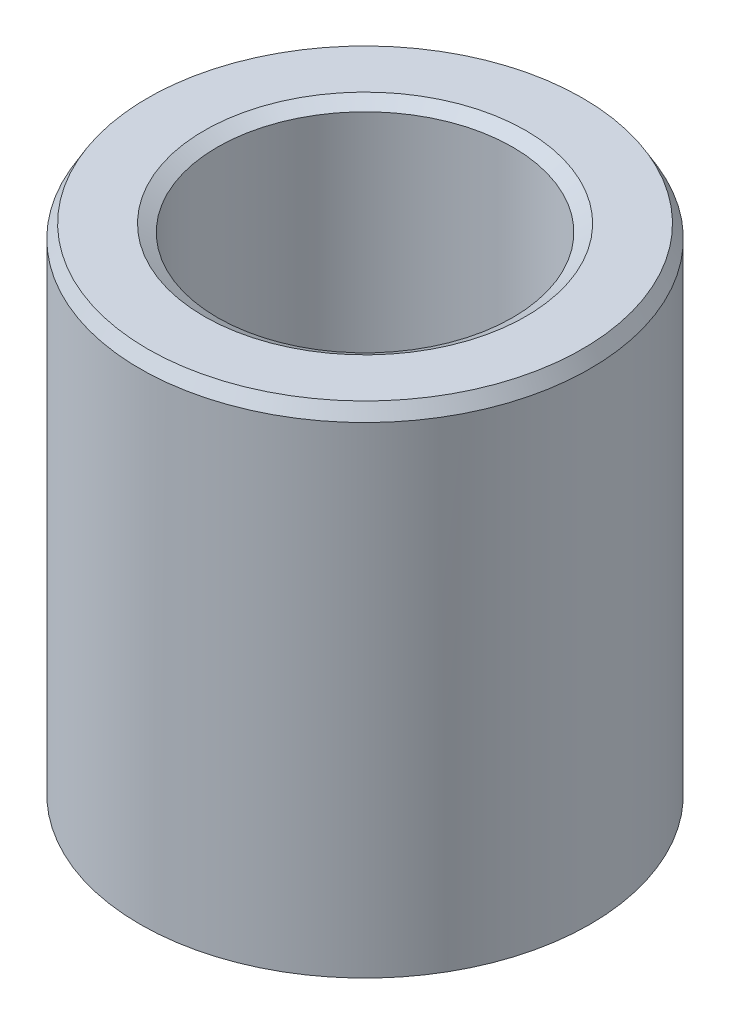
ISO-10303-21;
HEADER;
FILE_DESCRIPTION(('STEP AP214'),'2;1');
FILE_NAME('part.step','',(''),(''),'','','');
FILE_SCHEMA(('AUTOMOTIVE_DESIGN { 1 0 10303 214 1 1 1 1 }'));
ENDSEC;
DATA;
#1=APPLICATION_CONTEXT('core data for automotive mechanical design processes');
#2=APPLICATION_PROTOCOL_DEFINITION('international standard','automotive_design',2000,#1);
#3=PRODUCT_CONTEXT('',#1,'mechanical');
#4=PRODUCT('Part','Part','',(#3));
#5=PRODUCT_RELATED_PRODUCT_CATEGORY('part','',(#4));
#6=PRODUCT_DEFINITION_FORMATION('','',#4);
#7=PRODUCT_DEFINITION_CONTEXT('part definition',#1,'design');
#8=PRODUCT_DEFINITION('design','',#6,#7);
#9=PRODUCT_DEFINITION_SHAPE('','',#8);
#10=(LENGTH_UNIT() NAMED_UNIT(*) SI_UNIT(.MILLI.,.METRE.));
#11=(NAMED_UNIT(*) PLANE_ANGLE_UNIT() SI_UNIT($,.RADIAN.));
#12=(NAMED_UNIT(*) SI_UNIT($,.STERADIAN.) SOLID_ANGLE_UNIT());
#13=UNCERTAINTY_MEASURE_WITH_UNIT(LENGTH_MEASURE(1.E-05),#10,'distance_accuracy_value','');
#14=(GEOMETRIC_REPRESENTATION_CONTEXT(3) GLOBAL_UNCERTAINTY_ASSIGNED_CONTEXT((#13)) GLOBAL_UNIT_ASSIGNED_CONTEXT((#10,
#11,#12)) REPRESENTATION_CONTEXT('',''));
#15=CARTESIAN_POINT('',(0.,0.,0.));
#16=DIRECTION('',(0.,0.,1.));
#17=DIRECTION('',(1.,0.,0.));
#18=AXIS2_PLACEMENT_3D('',#15,#16,#17);
#19=CARTESIAN_POINT('',(0.,33.4597432472201,0.));
#20=DIRECTION('',(0.,-1.,0.));
#21=DIRECTION('',(0.,0.,-1.));
#22=AXIS2_PLACEMENT_3D('',#19,#20,#21);
#23=CYLINDRICAL_SURFACE('',#22,15.);
#24=CARTESIAN_POINT('',(0.,0.510710758820088,0.));
#25=DIRECTION('',(0.,1.,0.));
#26=DIRECTION('',(0.,0.,1.));
#27=AXIS2_PLACEMENT_3D('',#24,#25,#26);
#28=CIRCLE('',#27,15.);
#29=CARTESIAN_POINT('',(0.,0.510710758820088,15.));
#30=VERTEX_POINT('',#29);
#31=EDGE_CURVE('E10',#30,#30,#28,.T.);
#32=ORIENTED_EDGE('',*,*,#31,.T.);
#33=EDGE_LOOP('',(#32));
#34=FACE_BOUND('',#33,.T.);
#35=CARTESIAN_POINT('',(0.,32.5751662649717,0.));
#36=DIRECTION('',(0.,1.,0.));
#37=DIRECTION('',(0.,0.,1.));
#38=AXIS2_PLACEMENT_3D('',#35,#36,#37);
#39=CIRCLE('',#38,15.);
#40=CARTESIAN_POINT('',(0.,32.5751662649716,-15.));
#41=VERTEX_POINT('',#40);
#42=EDGE_CURVE('E50',#41,#41,#39,.F.);
#43=ORIENTED_EDGE('',*,*,#42,.T.);
#44=EDGE_LOOP('',(#43));
#45=FACE_BOUND('',#44,.T.);
#46=ADVANCED_FACE('F39',(#34,#45),#23,.T.);
#47=CARTESIAN_POINT('',(0.,33.4597432472201,0.));
#48=DIRECTION('',(0.,1.,0.));
#49=DIRECTION('',(0.,0.,1.));
#50=AXIS2_PLACEMENT_3D('',#47,#48,#49);
#51=PLANE('',#50);
#52=CARTESIAN_POINT('',(0.,33.4597432472201,0.));
#53=DIRECTION('',(0.,1.,0.));
#54=DIRECTION('',(0.,0.,1.));
#55=AXIS2_PLACEMENT_3D('',#52,#53,#54);
#56=CIRCLE('',#55,10.7254369156351);
#57=CARTESIAN_POINT('',(0.,33.4597432472201,10.7254369156351));
#58=VERTEX_POINT('',#57);
#59=EDGE_CURVE('E58',#58,#58,#56,.F.);
#60=ORIENTED_EDGE('',*,*,#59,.T.);
#61=EDGE_LOOP('',(#60));
#62=FACE_BOUND('',#61,.T.);
#63=CARTESIAN_POINT('',(0.,33.4597432472201,0.));
#64=DIRECTION('',(0.,1.,0.));
#65=DIRECTION('',(0.,0.,1.));
#66=AXIS2_PLACEMENT_3D('',#63,#64,#65);
#67=CIRCLE('',#66,14.4892892411799);
#68=CARTESIAN_POINT('',(0.,33.4597432472201,-14.4892892411799));
#69=VERTEX_POINT('',#68);
#70=EDGE_CURVE('E61',#69,#69,#67,.T.);
#71=ORIENTED_EDGE('',*,*,#70,.T.);
#72=EDGE_LOOP('',(#71));
#73=FACE_BOUND('',#72,.T.);
#74=ADVANCED_FACE('F88',(#62,#73),#51,.T.);
#75=CARTESIAN_POINT('',(0.,0.,0.));
#76=DIRECTION('',(0.,1.,0.));
#77=DIRECTION('',(0.,0.,1.));
#78=AXIS2_PLACEMENT_3D('',#75,#76,#77);
#79=PLANE('',#78);
#80=CARTESIAN_POINT('',(0.,0.,0.));
#81=DIRECTION('',(0.,1.,0.));
#82=DIRECTION('',(0.,0.,1.));
#83=AXIS2_PLACEMENT_3D('',#80,#81,#82);
#84=CIRCLE('',#83,10.3515706922067);
#85=CARTESIAN_POINT('',(0.,0.,-10.3515706922067));
#86=VERTEX_POINT('',#85);
#87=EDGE_CURVE('E51',#86,#86,#84,.T.);
#88=ORIENTED_EDGE('',*,*,#87,.T.);
#89=EDGE_LOOP('',(#88));
#90=FACE_BOUND('',#89,.T.);
#91=CARTESIAN_POINT('',(0.,0.,0.));
#92=DIRECTION('',(0.,1.,0.));
#93=DIRECTION('',(0.,0.,1.));
#94=AXIS2_PLACEMENT_3D('',#91,#92,#93);
#95=CIRCLE('',#94,14.1154230177515);
#96=CARTESIAN_POINT('',(0.,0.,14.1154230177515));
#97=VERTEX_POINT('',#96);
#98=EDGE_CURVE('E54',#97,#97,#95,.F.);
#99=ORIENTED_EDGE('',*,*,#98,.T.);
#100=EDGE_LOOP('',(#99));
#101=FACE_BOUND('',#100,.T.);
#102=ADVANCED_FACE('F83',(#90,#101),#79,.F.);
#103=CARTESIAN_POINT('',(0.,33.4597432472201,0.));
#104=DIRECTION('',(0.,-1.,0.));
#105=DIRECTION('',(0.,0.,-1.));
#106=AXIS2_PLACEMENT_3D('',#103,#104,#105);
#107=CYLINDRICAL_SURFACE('',#106,9.84085993338665);
#108=CARTESIAN_POINT('',(0.,32.9490324884,0.));
#109=DIRECTION('',(0.,1.,0.));
#110=DIRECTION('',(0.,0.,1.));
#111=AXIS2_PLACEMENT_3D('',#108,#109,#110);
#112=CIRCLE('',#111,9.84085993338665);
#113=CARTESIAN_POINT('',(0.,32.9490324884,9.84085993338665));
#114=VERTEX_POINT('',#113);
#115=EDGE_CURVE('E67',#114,#114,#112,.T.);
#116=ORIENTED_EDGE('',*,*,#115,.T.);
#117=EDGE_LOOP('',(#116));
#118=FACE_BOUND('',#117,.T.);
#119=CARTESIAN_POINT('',(0.,0.884576982248461,0.));
#120=DIRECTION('',(0.,1.,0.));
#121=DIRECTION('',(0.,0.,1.));
#122=AXIS2_PLACEMENT_3D('',#119,#120,#121);
#123=CIRCLE('',#122,9.84085993338665);
#124=CARTESIAN_POINT('',(0.,0.884576982248461,-9.84085993338665));
#125=VERTEX_POINT('',#124);
#126=EDGE_CURVE('E69',#125,#125,#123,.F.);
#127=ORIENTED_EDGE('',*,*,#126,.T.);
#128=EDGE_LOOP('',(#127));
#129=FACE_BOUND('',#128,.T.);
#130=ADVANCED_FACE('F71',(#118,#129),#107,.F.);
#131=CARTESIAN_POINT('',(0.,32.9490324884,0.));
#132=DIRECTION('',(0.,1.,0.));
#133=DIRECTION('',(0.,0.,1.));
#134=AXIS2_PLACEMENT_3D('',#131,#132,#133);
#135=CONICAL_SURFACE('',#134,9.84085993338665,1.0471975511966);
#136=ORIENTED_EDGE('',*,*,#59,.F.);
#137=EDGE_LOOP('',(#136));
#138=FACE_BOUND('',#137,.T.);
#139=ORIENTED_EDGE('',*,*,#115,.F.);
#140=EDGE_LOOP('',(#139));
#141=FACE_BOUND('',#140,.T.);
#142=ADVANCED_FACE('F77',(#138,#141),#135,.F.);
#143=CARTESIAN_POINT('',(0.,0.,0.));
#144=DIRECTION('',(0.,-1.,0.));
#145=DIRECTION('',(0.,0.,-1.));
#146=AXIS2_PLACEMENT_3D('',#143,#144,#145);
#147=CONICAL_SURFACE('',#146,10.3515706922067,0.523598775598293);
#148=CARTESIAN_POINT('',(0.,0.884576982248461,-9.84085993338665));
#149=CARTESIAN_POINT('',(0.,0.875362638683373,-9.84617983712436));
#150=CARTESIAN_POINT('',(0.,0.866148295118285,-9.85149974086207));
#151=CARTESIAN_POINT('',(0.,0.847719607988108,-9.86213954833749));
#152=CARTESIAN_POINT('',(0.,0.83850526442302,-9.8674594520752));
#153=CARTESIAN_POINT('',(0.,0.820076577292844,-9.87809925955062));
#154=CARTESIAN_POINT('',(0.,0.810862233727756,-9.88341916328833));
#155=CARTESIAN_POINT('',(0.,0.79243354659758,-9.89405897076374));
#156=CARTESIAN_POINT('',(0.,0.783219203032492,-9.89937887450145));
#157=CARTESIAN_POINT('',(0.,0.764790515902315,-9.91001868197687));
#158=CARTESIAN_POINT('',(0.,0.755576172337227,-9.91533858571458));
#159=CARTESIAN_POINT('',(0.,0.737147485207051,-9.92597839319));
#160=CARTESIAN_POINT('',(0.,0.727933141641963,-9.93129829692771));
#161=CARTESIAN_POINT('',(0.,0.709504454511786,-9.94193810440313));
#162=CARTESIAN_POINT('',(0.,0.700290110946698,-9.94725800814084));
#163=CARTESIAN_POINT('',(0.,0.681861423816522,-9.95789781561625));
#164=CARTESIAN_POINT('',(0.,0.672647080251434,-9.96321771935396));
#165=CARTESIAN_POINT('',(0.,0.654218393121258,-9.97385752682938));
#166=CARTESIAN_POINT('',(0.,0.64500404955617,-9.97917743056709));
#167=CARTESIAN_POINT('',(0.,0.626575362425993,-9.98981723804251));
#168=CARTESIAN_POINT('',(0.,0.617361018860905,-9.99513714178022));
#169=CARTESIAN_POINT('',(0.,0.598932331730729,-10.0057769492556));
#170=CARTESIAN_POINT('',(0.,0.589717988165641,-10.0110968529933));
#171=CARTESIAN_POINT('',(0.,0.571289301035464,-10.0217366604688));
#172=CARTESIAN_POINT('',(0.,0.562074957470376,-10.0270565642065));
#173=CARTESIAN_POINT('',(0.,0.5436462703402,-10.0376963716819));
#174=CARTESIAN_POINT('',(0.,0.534431926775112,-10.0430162754196));
#175=CARTESIAN_POINT('',(0.,0.516003239644936,-10.053656082895));
#176=CARTESIAN_POINT('',(0.,0.506788896079847,-10.0589759866327));
#177=CARTESIAN_POINT('',(0.,0.488360208949671,-10.0696157941081));
#178=CARTESIAN_POINT('',(0.,0.479145865384583,-10.0749356978459));
#179=CARTESIAN_POINT('',(0.,0.460717178254407,-10.0855755053213));
#180=CARTESIAN_POINT('',(0.,0.451502834689319,-10.090895409059));
#181=CARTESIAN_POINT('',(0.,0.433074147559143,-10.1015352165344));
#182=CARTESIAN_POINT('',(0.,0.423859803994054,-10.1068551202721));
#183=CARTESIAN_POINT('',(0.,0.405431116863878,-10.1174949277475));
#184=CARTESIAN_POINT('',(0.,0.39621677329879,-10.1228148314852));
#185=CARTESIAN_POINT('',(0.,0.377788086168614,-10.1334546389607));
#186=CARTESIAN_POINT('',(0.,0.368573742603525,-10.1387745426984));
#187=CARTESIAN_POINT('',(0.,0.350145055473349,-10.1494143501738));
#188=CARTESIAN_POINT('',(0.,0.340930711908261,-10.1547342539115));
#189=CARTESIAN_POINT('',(0.,0.322502024778085,-10.1653740613869));
#190=CARTESIAN_POINT('',(0.,0.313287681212997,-10.1706939651246));
#191=CARTESIAN_POINT('',(0.,0.29485899408282,-10.1813337726));
#192=CARTESIAN_POINT('',(0.,0.285644650517732,-10.1866536763378));
#193=CARTESIAN_POINT('',(0.,0.267215963387556,-10.1972934838132));
#194=CARTESIAN_POINT('',(0.,0.258001619822468,-10.2026133875509));
#195=CARTESIAN_POINT('',(0.,0.239572932692292,-10.2132531950263));
#196=CARTESIAN_POINT('',(0.,0.230358589127203,-10.218573098764));
#197=CARTESIAN_POINT('',(0.,0.211929901997027,-10.2292129062394));
#198=CARTESIAN_POINT('',(0.,0.202715558431939,-10.2345328099771));
#199=CARTESIAN_POINT('',(0.,0.184286871301763,-10.2451726174526));
#200=CARTESIAN_POINT('',(0.,0.175072527736675,-10.2504925211903));
#201=CARTESIAN_POINT('',(0.,0.156643840606498,-10.2611323286657));
#202=CARTESIAN_POINT('',(0.,0.14742949704141,-10.2664522324034));
#203=CARTESIAN_POINT('',(0.,0.129000809911234,-10.2770920398788));
#204=CARTESIAN_POINT('',(0.,0.119786466346146,-10.2824119436165));
#205=CARTESIAN_POINT('',(0.,0.10135777921597,-10.2930517510919));
#206=CARTESIAN_POINT('',(0.,0.0921434356508814,-10.2983716548296));
#207=CARTESIAN_POINT('',(0.,0.0737147485207051,-10.3090114623051));
#208=CARTESIAN_POINT('',(0.,0.0645004049556169,-10.3143313660428));
#209=CARTESIAN_POINT('',(0.,0.0460717178254407,-10.3249711735182));
#210=CARTESIAN_POINT('',(0.,0.0368573742603525,-10.3302910772559));
#211=CARTESIAN_POINT('',(0.,0.0184286871301763,-10.3409308847313));
#212=CARTESIAN_POINT('',(0.,0.00921434356508814,-10.346250788469));
#213=CARTESIAN_POINT('',(0.,0.,-10.3515706922067));
#214=B_SPLINE_CURVE_WITH_KNOTS('',3,(#148,#149,#150,#151,#152,#153,#154,#155,#156,#157,#158,
#159,#160,#161,#162,#163,#164,#165,#166,#167,#168,#169,#170,#171,#172,#173,#174,#175,#176,#177,
#178,#179,#180,#181,#182,#183,#184,#185,#186,#187,#188,#189,#190,#191,#192,#193,#194,#195,#196,
#197,#198,#199,#200,#201,#202,#203,#204,#205,#206,#207,#208,#209,#210,#211,#212,#213),
.UNSPECIFIED.,.F.,.F.,(4,2,2,2,2,2,2,2,2,2,2,2,2,2,2,2,2,2,2,2,2,2,2,2,2,2,2,2,2,2,2,2,4),(0.,
0.0319194224262559,0.0638388448525117,0.0957582672787676,0.127677689705023,0.159597112131279,
0.191516534557535,0.223435956983791,0.255355379410047,0.287274801836303,0.319194224262559,
0.351113646688815,0.38303306911507,0.414952491541326,0.446871913967582,0.478791336393838,
0.510710758820095,0.542630181246351,0.574549603672606,0.606469026098862,0.638388448525118,
0.670307870951374,0.70222729337763,0.734146715803886,0.766066138230142,0.797985560656398,
0.829904983082654,0.861824405508909,0.893743827935165,0.925663250361421,0.957582672787677,
0.989502095213933,1.02142151764019),.UNSPECIFIED.);
#215=EDGE_CURVE('BSEAM73',#125,#86,#214,.T.);
#216=ORIENTED_EDGE('',*,*,#126,.F.);
#217=ORIENTED_EDGE('',*,*,#87,.F.);
#218=ORIENTED_EDGE('',*,*,#215,.T.);
#219=ORIENTED_EDGE('',*,*,#215,.F.);
#220=EDGE_LOOP('',(#216,#218,#217,#219));
#221=FACE_BOUND('',#220,.T.);
#222=ADVANCED_FACE('F73',(#221),#147,.F.);
#223=CARTESIAN_POINT('',(0.,0.510710758820088,0.));
#224=DIRECTION('',(0.,1.,0.));
#225=DIRECTION('',(0.,0.,1.));
#226=AXIS2_PLACEMENT_3D('',#223,#224,#225);
#227=CONICAL_SURFACE('',#226,15.,1.0471975511966);
#228=ORIENTED_EDGE('',*,*,#98,.F.);
#229=EDGE_LOOP('',(#228));
#230=FACE_BOUND('',#229,.T.);
#231=ORIENTED_EDGE('',*,*,#31,.F.);
#232=EDGE_LOOP('',(#231));
#233=FACE_BOUND('',#232,.T.);
#234=ADVANCED_FACE('F76',(#230,#233),#227,.T.);
#235=CARTESIAN_POINT('',(0.,33.4597432472201,0.));
#236=DIRECTION('',(0.,-1.,0.));
#237=DIRECTION('',(0.,0.,-1.));
#238=AXIS2_PLACEMENT_3D('',#235,#236,#237);
#239=CONICAL_SURFACE('',#238,14.4892892411799,0.523598775598294);
#240=CARTESIAN_POINT('',(0.,32.5751662649716,-15.));
#241=CARTESIAN_POINT('',(0.,32.5843806085367,-14.9946800962623));
#242=CARTESIAN_POINT('',(0.,32.5935949521018,-14.9893601925246));
#243=CARTESIAN_POINT('',(0.,32.612023639232,-14.9787203850492));
#244=CARTESIAN_POINT('',(0.,32.6212379827971,-14.9734004813115));
#245=CARTESIAN_POINT('',(0.,32.6396666699273,-14.962760673836));
#246=CARTESIAN_POINT('',(0.,32.6488810134924,-14.9574407700983));
#247=CARTESIAN_POINT('',(0.,32.6673097006225,-14.9468009626229));
#248=CARTESIAN_POINT('',(0.,32.6765240441876,-14.9414810588852));
#249=CARTESIAN_POINT('',(0.,32.6949527313178,-14.9308412514098));
#250=CARTESIAN_POINT('',(0.,32.7041670748829,-14.9255213476721));
#251=CARTESIAN_POINT('',(0.,32.7225957620131,-14.9148815401967));
#252=CARTESIAN_POINT('',(0.,32.7318101055781,-14.9095616364589));
#253=CARTESIAN_POINT('',(0.,32.7502387927083,-14.8989218289835));
#254=CARTESIAN_POINT('',(0.,32.7594531362734,-14.8936019252458));
#255=CARTESIAN_POINT('',(0.,32.7778818234036,-14.8829621177704));
#256=CARTESIAN_POINT('',(0.,32.7870961669687,-14.8776422140327));
#257=CARTESIAN_POINT('',(0.,32.8055248540988,-14.8670024065573));
#258=CARTESIAN_POINT('',(0.,32.8147391976639,-14.8616825028196));
#259=CARTESIAN_POINT('',(0.,32.8331678847941,-14.8510426953441));
#260=CARTESIAN_POINT('',(0.,32.8423822283592,-14.8457227916064));
#261=CARTESIAN_POINT('',(0.,32.8608109154894,-14.835082984131));
#262=CARTESIAN_POINT('',(0.,32.8700252590545,-14.8297630803933));
#263=CARTESIAN_POINT('',(0.,32.8884539461846,-14.8191232729179));
#264=CARTESIAN_POINT('',(0.,32.8976682897497,-14.8138033691802));
#265=CARTESIAN_POINT('',(0.,32.9160969768799,-14.8031635617048));
#266=CARTESIAN_POINT('',(0.,32.925311320445,-14.7978436579671));
#267=CARTESIAN_POINT('',(0.,32.9437400075752,-14.7872038504916));
#268=CARTESIAN_POINT('',(0.,32.9529543511403,-14.7818839467539));
#269=CARTESIAN_POINT('',(0.,32.9713830382704,-14.7712441392785));
#270=CARTESIAN_POINT('',(0.,32.9805973818355,-14.7659242355408));
#271=CARTESIAN_POINT('',(0.,32.9990260689657,-14.7552844280654));
#272=CARTESIAN_POINT('',(0.,33.0082404125308,-14.7499645243277));
#273=CARTESIAN_POINT('',(0.,33.026669099661,-14.7393247168523));
#274=CARTESIAN_POINT('',(0.,33.035883443226,-14.7340048131145));
#275=CARTESIAN_POINT('',(0.,33.0543121303562,-14.7233650056391));
#276=CARTESIAN_POINT('',(0.,33.0635264739213,-14.7180451019014));
#277=CARTESIAN_POINT('',(0.,33.0819551610515,-14.707405294426));
#278=CARTESIAN_POINT('',(0.,33.0911695046166,-14.7020853906883));
#279=CARTESIAN_POINT('',(0.,33.1095981917467,-14.6914455832129));
#280=CARTESIAN_POINT('',(0.,33.1188125353118,-14.6861256794752));
#281=CARTESIAN_POINT('',(0.,33.137241222442,-14.6754858719997));
#282=CARTESIAN_POINT('',(0.,33.1464555660071,-14.670165968262));
#283=CARTESIAN_POINT('',(0.,33.1648842531373,-14.6595261607866));
#284=CARTESIAN_POINT('',(0.,33.1740985967024,-14.6542062570489));
#285=CARTESIAN_POINT('',(0.,33.1925272838325,-14.6435664495735));
#286=CARTESIAN_POINT('',(0.,33.2017416273976,-14.6382465458358));
#287=CARTESIAN_POINT('',(0.,33.2201703145278,-14.6276067383604));
#288=CARTESIAN_POINT('',(0.,33.2293846580929,-14.6222868346227));
#289=CARTESIAN_POINT('',(0.,33.2478133452231,-14.6116470271472));
#290=CARTESIAN_POINT('',(0.,33.2570276887882,-14.6063271234095));
#291=CARTESIAN_POINT('',(0.,33.2754563759183,-14.5956873159341));
#292=CARTESIAN_POINT('',(0.,33.2846707194834,-14.5903674121964));
#293=CARTESIAN_POINT('',(0.,33.3030994066136,-14.579727604721));
#294=CARTESIAN_POINT('',(0.,33.3123137501787,-14.5744077009833));
#295=CARTESIAN_POINT('',(0.,33.3307424373089,-14.5637678935079));
#296=CARTESIAN_POINT('',(0.,33.3399567808739,-14.5584479897701));
#297=CARTESIAN_POINT('',(0.,33.3583854680041,-14.5478081822947));
#298=CARTESIAN_POINT('',(0.,33.3675998115692,-14.542488278557));
#299=CARTESIAN_POINT('',(0.,33.3860284986994,-14.5318484710816));
#300=CARTESIAN_POINT('',(0.,33.3952428422645,-14.5265285673439));
#301=CARTESIAN_POINT('',(0.,33.4136715293946,-14.5158887598685));
#302=CARTESIAN_POINT('',(0.,33.4228858729597,-14.5105688561308));
#303=CARTESIAN_POINT('',(0.,33.4413145600899,-14.4999290486553));
#304=CARTESIAN_POINT('',(0.,33.450528903655,-14.4946091449176));
#305=CARTESIAN_POINT('',(0.,33.4597432472201,-14.4892892411799));
#306=B_SPLINE_CURVE_WITH_KNOTS('',3,(#240,#241,#242,#243,#244,#245,#246,#247,#248,#249,#250,
#251,#252,#253,#254,#255,#256,#257,#258,#259,#260,#261,#262,#263,#264,#265,#266,#267,#268,#269,
#270,#271,#272,#273,#274,#275,#276,#277,#278,#279,#280,#281,#282,#283,#284,#285,#286,#287,#288,
#289,#290,#291,#292,#293,#294,#295,#296,#297,#298,#299,#300,#301,#302,#303,#304,#305),
.UNSPECIFIED.,.F.,.F.,(4,2,2,2,2,2,2,2,2,2,2,2,2,2,2,2,2,2,2,2,2,2,2,2,2,2,2,2,2,2,2,2,4),(0.,
0.0319194224262577,0.0638388448525146,0.0957582672787664,0.127677689705024,0.159597112131275,
0.191516534557533,0.223435956983784,0.255355379410042,0.2872748018363,0.319194224262551,
0.351113646688809,0.38303306911506,0.414952491541318,0.446871913967569,0.478791336393827,
0.510710758820078,0.542630181246336,0.574549603672593,0.606469026098845,0.638388448525103,
0.670307870951354,0.702227293377611,0.734146715803863,0.76606613823012,0.797985560656378,
0.829904983082629,0.861824405508887,0.893743827935139,0.925663250361396,0.957582672787647,
0.989502095213905,1.02142151764016),.UNSPECIFIED.);
#307=EDGE_CURVE('BSEAM45',#41,#69,#306,.T.);
#308=ORIENTED_EDGE('',*,*,#42,.F.);
#309=ORIENTED_EDGE('',*,*,#70,.F.);
#310=ORIENTED_EDGE('',*,*,#307,.T.);
#311=ORIENTED_EDGE('',*,*,#307,.F.);
#312=EDGE_LOOP('',(#308,#310,#309,#311));
#313=FACE_BOUND('',#312,.T.);
#314=ADVANCED_FACE('F45',(#313),#239,.T.);
#315=CLOSED_SHELL('',(#46,#74,#102,#130,#142,#222,#234,#314));
#316=MANIFOLD_SOLID_BREP('B2',#315);
#317=ADVANCED_BREP_SHAPE_REPRESENTATION('',(#18,#316),#14);
#318=SHAPE_DEFINITION_REPRESENTATION(#9,#317);
ENDSEC;
END-ISO-10303-21;
